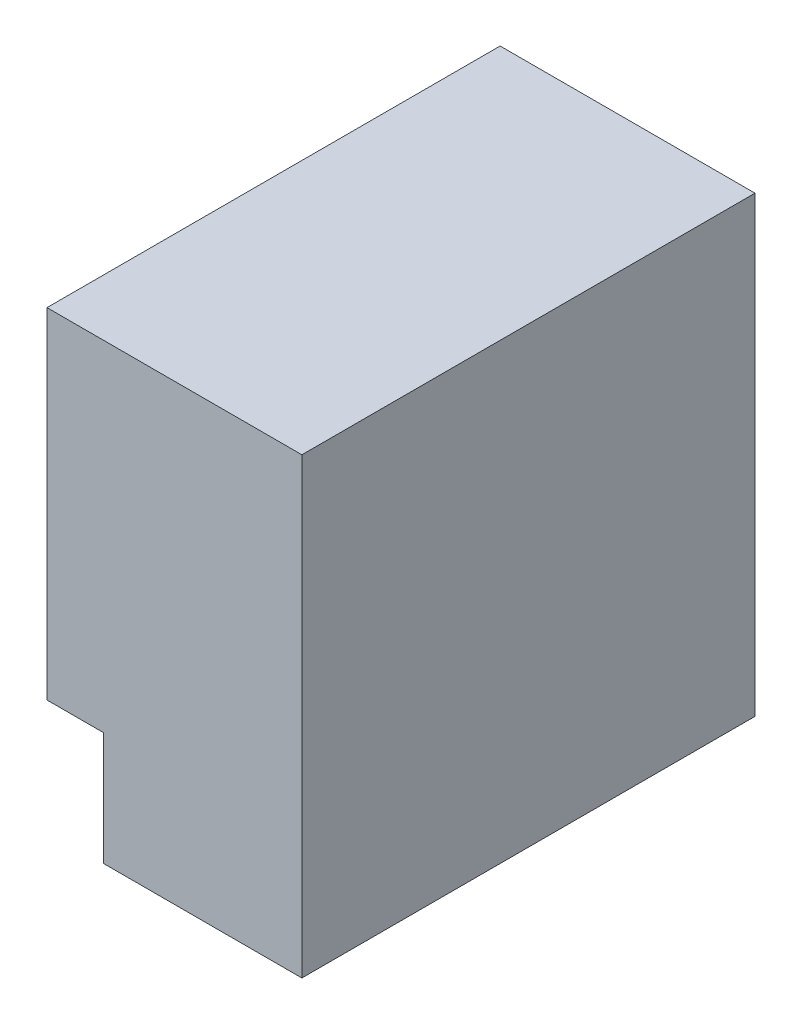
ISO-10303-21;
HEADER;
FILE_DESCRIPTION(('STEP AP214'),'2;1');
FILE_NAME('part.step','',(''),(''),'','','');
FILE_SCHEMA(('AUTOMOTIVE_DESIGN { 1 0 10303 214 1 1 1 1 }'));
ENDSEC;
DATA;
#1=APPLICATION_CONTEXT('core data for automotive mechanical design processes');
#2=APPLICATION_PROTOCOL_DEFINITION('international standard','automotive_design',2000,#1);
#3=PRODUCT_CONTEXT('',#1,'mechanical');
#4=PRODUCT('Part','Part','',(#3));
#5=PRODUCT_RELATED_PRODUCT_CATEGORY('part','',(#4));
#6=PRODUCT_DEFINITION_FORMATION('','',#4);
#7=PRODUCT_DEFINITION_CONTEXT('part definition',#1,'design');
#8=PRODUCT_DEFINITION('design','',#6,#7);
#9=PRODUCT_DEFINITION_SHAPE('','',#8);
#10=(LENGTH_UNIT() NAMED_UNIT(*) SI_UNIT(.MILLI.,.METRE.));
#11=(NAMED_UNIT(*) PLANE_ANGLE_UNIT() SI_UNIT($,.RADIAN.));
#12=(NAMED_UNIT(*) SI_UNIT($,.STERADIAN.) SOLID_ANGLE_UNIT());
#13=UNCERTAINTY_MEASURE_WITH_UNIT(LENGTH_MEASURE(1.E-05),#10,'distance_accuracy_value','');
#14=(GEOMETRIC_REPRESENTATION_CONTEXT(3) GLOBAL_UNCERTAINTY_ASSIGNED_CONTEXT((#13)) GLOBAL_UNIT_ASSIGNED_CONTEXT((#10,
#11,#12)) REPRESENTATION_CONTEXT('',''));
#15=CARTESIAN_POINT('',(0.,0.,0.));
#16=DIRECTION('',(0.,0.,1.));
#17=DIRECTION('',(1.,0.,0.));
#18=AXIS2_PLACEMENT_3D('',#15,#16,#17);
#19=CARTESIAN_POINT('',(-16.6432255553676,43.0000000000214,-14.870292169545));
#20=DIRECTION('',(1.,0.,0.));
#21=DIRECTION('',(0.,0.,-1.));
#22=AXIS2_PLACEMENT_3D('',#19,#20,#21);
#23=PLANE('',#22);
#24=CARTESIAN_POINT('',(-16.6432255553676,23.0000000000214,5.12970783045501));
#25=DIRECTION('',(-1.,0.,0.));
#26=DIRECTION('',(0.,0.,1.));
#27=AXIS2_PLACEMENT_3D('',#24,#25,#26);
#28=CIRCLE('',#27,1.24999999999999);
#29=CARTESIAN_POINT('',(-16.6432255553676,23.0000000000214,6.379707830455));
#30=VERTEX_POINT('',#29);
#31=EDGE_CURVE('E130',#30,#30,#28,.T.);
#32=ORIENTED_EDGE('',*,*,#31,.F.);
#33=EDGE_LOOP('',(#32));
#34=FACE_BOUND('',#33,.T.);
#35=DIRECTION('',(0.,-1.,0.));
#36=VECTOR('',#35,1.);
#37=CARTESIAN_POINT('',(-16.6432255553676,43.0000000000214,-14.870292169545));
#38=LINE('',#37,#36);
#39=CARTESIAN_POINT('',(-16.6432255553676,43.0000000000214,-14.870292169545));
#40=VERTEX_POINT('',#39);
#41=CARTESIAN_POINT('',(-16.6432255553676,13.0000000000214,-14.870292169545));
#42=VERTEX_POINT('',#41);
#43=EDGE_CURVE('E45',#40,#42,#38,.T.);
#44=ORIENTED_EDGE('',*,*,#43,.T.);
#45=DIRECTION('',(0.,0.,1.));
#46=VECTOR('',#45,1.);
#47=CARTESIAN_POINT('',(-16.6432255553676,13.0000000000214,-14.870292169545));
#48=LINE('',#47,#46);
#49=CARTESIAN_POINT('',(-16.6432255553676,13.0000000000214,25.129707830455));
#50=VERTEX_POINT('',#49);
#51=EDGE_CURVE('E152',#42,#50,#48,.T.);
#52=ORIENTED_EDGE('',*,*,#51,.T.);
#53=DIRECTION('',(0.,-1.,0.));
#54=VECTOR('',#53,1.);
#55=CARTESIAN_POINT('',(-16.6432255553676,43.0000000000214,25.129707830455));
#56=LINE('',#55,#54);
#57=CARTESIAN_POINT('',(-16.6432255553676,43.0000000000214,25.129707830455));
#58=VERTEX_POINT('',#57);
#59=EDGE_CURVE('E173',#58,#50,#56,.T.);
#60=ORIENTED_EDGE('',*,*,#59,.F.);
#61=DIRECTION('',(0.,0.,1.));
#62=VECTOR('',#61,1.);
#63=CARTESIAN_POINT('',(-16.6432255553676,43.0000000000214,-14.870292169545));
#64=LINE('',#63,#62);
#65=EDGE_CURVE('E162',#40,#58,#64,.T.);
#66=ORIENTED_EDGE('',*,*,#65,.F.);
#67=EDGE_LOOP('',(#44,#52,#60,#66));
#68=FACE_BOUND('',#67,.T.);
#69=CARTESIAN_POINT('',(-16.6432255553676,33.0000000000214,5.12970783045501));
#70=DIRECTION('',(-1.,0.,0.));
#71=DIRECTION('',(0.,0.,1.));
#72=AXIS2_PLACEMENT_3D('',#69,#70,#71);
#73=CIRCLE('',#72,1.24999999999999);
#74=CARTESIAN_POINT('',(-16.6432255553676,33.0000000000214,6.379707830455));
#75=VERTEX_POINT('',#74);
#76=EDGE_CURVE('E136',#75,#75,#73,.T.);
#77=ORIENTED_EDGE('',*,*,#76,.F.);
#78=EDGE_LOOP('',(#77));
#79=FACE_BOUND('',#78,.T.);
#80=ADVANCED_FACE('F37',(#34,#68,#79),#23,.F.);
#81=CARTESIAN_POINT('',(5.85677444463244,43.0000000000214,-14.870292169545));
#82=DIRECTION('',(-1.,0.,0.));
#83=DIRECTION('',(0.,0.,1.));
#84=AXIS2_PLACEMENT_3D('',#81,#82,#83);
#85=PLANE('',#84);
#86=DIRECTION('',(0.,0.,-1.));
#87=VECTOR('',#86,1.);
#88=CARTESIAN_POINT('',(5.85677444463244,3.00000000002137,-14.870292169545));
#89=LINE('',#88,#87);
#90=CARTESIAN_POINT('',(5.85677444463244,3.00000000002137,25.129707830455));
#91=VERTEX_POINT('',#90);
#92=CARTESIAN_POINT('',(5.85677444463244,3.00000000002137,-14.870292169545));
#93=VERTEX_POINT('',#92);
#94=EDGE_CURVE('E155',#91,#93,#89,.T.);
#95=ORIENTED_EDGE('',*,*,#94,.T.);
#96=DIRECTION('',(0.,-1.,0.));
#97=VECTOR('',#96,1.);
#98=CARTESIAN_POINT('',(5.85677444463244,43.0000000000214,-14.870292169545));
#99=LINE('',#98,#97);
#100=CARTESIAN_POINT('',(5.85677444463244,43.0000000000214,-14.870292169545));
#101=VERTEX_POINT('',#100);
#102=EDGE_CURVE('E11',#101,#93,#99,.T.);
#103=ORIENTED_EDGE('',*,*,#102,.F.);
#104=DIRECTION('',(0.,0.,-1.));
#105=VECTOR('',#104,1.);
#106=CARTESIAN_POINT('',(5.85677444463244,43.0000000000214,-14.870292169545));
#107=LINE('',#106,#105);
#108=CARTESIAN_POINT('',(5.85677444463244,43.0000000000214,25.129707830455));
#109=VERTEX_POINT('',#108);
#110=EDGE_CURVE('E159',#109,#101,#107,.T.);
#111=ORIENTED_EDGE('',*,*,#110,.F.);
#112=DIRECTION('',(0.,-1.,0.));
#113=VECTOR('',#112,1.);
#114=CARTESIAN_POINT('',(5.85677444463244,43.0000000000214,25.129707830455));
#115=LINE('',#114,#113);
#116=EDGE_CURVE('E165',#109,#91,#115,.T.);
#117=ORIENTED_EDGE('',*,*,#116,.T.);
#118=EDGE_LOOP('',(#95,#103,#111,#117));
#119=FACE_BOUND('',#118,.T.);
#120=ADVANCED_FACE('F39',(#119),#85,.F.);
#121=CARTESIAN_POINT('',(5.85677444463244,43.0000000000214,-14.870292169545));
#122=DIRECTION('',(0.,0.,1.));
#123=DIRECTION('',(1.,0.,0.));
#124=AXIS2_PLACEMENT_3D('',#121,#122,#123);
#125=PLANE('',#124);
#126=DIRECTION('',(0.,1.,0.));
#127=VECTOR('',#126,1.);
#128=CARTESIAN_POINT('',(-11.6432255553676,3.00000000002137,-14.870292169545));
#129=LINE('',#128,#127);
#130=CARTESIAN_POINT('',(-11.6432255553676,3.00000000002137,-14.870292169545));
#131=VERTEX_POINT('',#130);
#132=CARTESIAN_POINT('',(-11.6432255553676,13.0000000000214,-14.870292169545));
#133=VERTEX_POINT('',#132);
#134=EDGE_CURVE('E52',#131,#133,#129,.T.);
#135=ORIENTED_EDGE('',*,*,#134,.T.);
#136=DIRECTION('',(-1.,0.,0.));
#137=VECTOR('',#136,1.);
#138=CARTESIAN_POINT('',(-16.6432255553676,13.0000000000214,-14.870292169545));
#139=LINE('',#138,#137);
#140=EDGE_CURVE('E144',#133,#42,#139,.T.);
#141=ORIENTED_EDGE('',*,*,#140,.T.);
#142=ORIENTED_EDGE('',*,*,#43,.F.);
#143=DIRECTION('',(-1.,0.,0.));
#144=VECTOR('',#143,1.);
#145=CARTESIAN_POINT('',(5.85677444463244,43.0000000000214,-14.870292169545));
#146=LINE('',#145,#144);
#147=EDGE_CURVE('E83',#101,#40,#146,.T.);
#148=ORIENTED_EDGE('',*,*,#147,.F.);
#149=ORIENTED_EDGE('',*,*,#102,.T.);
#150=DIRECTION('',(-1.,0.,0.));
#151=VECTOR('',#150,1.);
#152=CARTESIAN_POINT('',(5.85677444463244,3.00000000002137,-14.870292169545));
#153=LINE('',#152,#151);
#154=EDGE_CURVE('E168',#93,#131,#153,.T.);
#155=ORIENTED_EDGE('',*,*,#154,.T.);
#156=EDGE_LOOP('',(#135,#141,#142,#148,#149,#155));
#157=FACE_BOUND('',#156,.T.);
#158=ADVANCED_FACE('F180',(#157),#125,.F.);
#159=CARTESIAN_POINT('',(5.85677444463244,43.0000000000214,25.129707830455));
#160=DIRECTION('',(0.,0.,-1.));
#161=DIRECTION('',(-1.,0.,0.));
#162=AXIS2_PLACEMENT_3D('',#159,#160,#161);
#163=PLANE('',#162);
#164=ORIENTED_EDGE('',*,*,#59,.T.);
#165=DIRECTION('',(-1.,0.,0.));
#166=VECTOR('',#165,1.);
#167=CARTESIAN_POINT('',(-16.6432255553676,13.0000000000214,25.129707830455));
#168=LINE('',#167,#166);
#169=CARTESIAN_POINT('',(-11.6432255553676,13.0000000000214,25.129707830455));
#170=VERTEX_POINT('',#169);
#171=EDGE_CURVE('E145',#170,#50,#168,.T.);
#172=ORIENTED_EDGE('',*,*,#171,.F.);
#173=DIRECTION('',(0.,1.,0.));
#174=VECTOR('',#173,1.);
#175=CARTESIAN_POINT('',(-11.6432255553676,3.00000000002137,25.129707830455));
#176=LINE('',#175,#174);
#177=CARTESIAN_POINT('',(-11.6432255553676,3.00000000002137,25.129707830455));
#178=VERTEX_POINT('',#177);
#179=EDGE_CURVE('E142',#178,#170,#176,.T.);
#180=ORIENTED_EDGE('',*,*,#179,.F.);
#181=DIRECTION('',(1.,0.,0.));
#182=VECTOR('',#181,1.);
#183=CARTESIAN_POINT('',(5.85677444463244,3.00000000002137,25.129707830455));
#184=LINE('',#183,#182);
#185=EDGE_CURVE('E76',#178,#91,#184,.T.);
#186=ORIENTED_EDGE('',*,*,#185,.T.);
#187=ORIENTED_EDGE('',*,*,#116,.F.);
#188=DIRECTION('',(1.,0.,0.));
#189=VECTOR('',#188,1.);
#190=CARTESIAN_POINT('',(5.85677444463244,43.0000000000214,25.129707830455));
#191=LINE('',#190,#189);
#192=EDGE_CURVE('E61',#58,#109,#191,.T.);
#193=ORIENTED_EDGE('',*,*,#192,.F.);
#194=EDGE_LOOP('',(#164,#172,#180,#186,#187,#193));
#195=FACE_BOUND('',#194,.T.);
#196=ADVANCED_FACE('F185',(#195),#163,.F.);
#197=CARTESIAN_POINT('',(5.85677444463244,43.0000000000214,25.129707830455));
#198=DIRECTION('',(0.,-1.,0.));
#199=DIRECTION('',(0.,0.,-1.));
#200=AXIS2_PLACEMENT_3D('',#197,#198,#199);
#201=PLANE('',#200);
#202=ORIENTED_EDGE('',*,*,#110,.T.);
#203=ORIENTED_EDGE('',*,*,#147,.T.);
#204=ORIENTED_EDGE('',*,*,#65,.T.);
#205=ORIENTED_EDGE('',*,*,#192,.T.);
#206=EDGE_LOOP('',(#202,#203,#204,#205));
#207=FACE_BOUND('',#206,.T.);
#208=ADVANCED_FACE('F190',(#207),#201,.F.);
#209=CARTESIAN_POINT('',(5.85677444463244,3.00000000002137,25.129707830455));
#210=DIRECTION('',(0.,-1.,0.));
#211=DIRECTION('',(0.,0.,-1.));
#212=AXIS2_PLACEMENT_3D('',#209,#210,#211);
#213=PLANE('',#212);
#214=CARTESIAN_POINT('',(-2.14322555536756,3.00000000002137,17.1297078304551));
#215=DIRECTION('',(0.,-1.,0.));
#216=DIRECTION('',(0.,0.,-1.));
#217=AXIS2_PLACEMENT_3D('',#214,#215,#216);
#218=CIRCLE('',#217,1.24999999999999);
#219=CARTESIAN_POINT('',(-2.14322555536756,3.00000000002137,15.8797078304551));
#220=VERTEX_POINT('',#219);
#221=EDGE_CURVE('E120',#220,#220,#218,.T.);
#222=ORIENTED_EDGE('',*,*,#221,.F.);
#223=EDGE_LOOP('',(#222));
#224=FACE_BOUND('',#223,.T.);
#225=CARTESIAN_POINT('',(-2.14322555536756,3.00000000002137,-6.87029216954493));
#226=DIRECTION('',(0.,-1.,0.));
#227=DIRECTION('',(0.,0.,-1.));
#228=AXIS2_PLACEMENT_3D('',#225,#226,#227);
#229=CIRCLE('',#228,1.24999999999999);
#230=CARTESIAN_POINT('',(-2.14322555536756,3.00000000002137,-8.12029216954492));
#231=VERTEX_POINT('',#230);
#232=EDGE_CURVE('E119',#231,#231,#229,.T.);
#233=ORIENTED_EDGE('',*,*,#232,.F.);
#234=EDGE_LOOP('',(#233));
#235=FACE_BOUND('',#234,.T.);
#236=DIRECTION('',(0.,0.,1.));
#237=VECTOR('',#236,1.);
#238=CARTESIAN_POINT('',(-11.6432255553676,3.00000000002137,-14.870292169545));
#239=LINE('',#238,#237);
#240=EDGE_CURVE('E148',#131,#178,#239,.T.);
#241=ORIENTED_EDGE('',*,*,#240,.F.);
#242=ORIENTED_EDGE('',*,*,#154,.F.);
#243=ORIENTED_EDGE('',*,*,#94,.F.);
#244=ORIENTED_EDGE('',*,*,#185,.F.);
#245=EDGE_LOOP('',(#241,#242,#243,#244));
#246=FACE_BOUND('',#245,.T.);
#247=ADVANCED_FACE('F192',(#224,#235,#246),#213,.T.);
#248=CARTESIAN_POINT('',(-16.6432255553676,13.0000000000214,-14.870292169545));
#249=DIRECTION('',(0.,1.,0.));
#250=DIRECTION('',(0.,0.,1.));
#251=AXIS2_PLACEMENT_3D('',#248,#249,#250);
#252=PLANE('',#251);
#253=ORIENTED_EDGE('',*,*,#171,.T.);
#254=ORIENTED_EDGE('',*,*,#51,.F.);
#255=ORIENTED_EDGE('',*,*,#140,.F.);
#256=DIRECTION('',(0.,0.,1.));
#257=VECTOR('',#256,1.);
#258=CARTESIAN_POINT('',(-11.6432255553676,13.0000000000214,-14.870292169545));
#259=LINE('',#258,#257);
#260=EDGE_CURVE('E156',#133,#170,#259,.T.);
#261=ORIENTED_EDGE('',*,*,#260,.T.);
#262=EDGE_LOOP('',(#253,#254,#255,#261));
#263=FACE_BOUND('',#262,.T.);
#264=ADVANCED_FACE('F183',(#263),#252,.F.);
#265=CARTESIAN_POINT('',(-11.6432255553676,3.00000000002137,-14.870292169545));
#266=DIRECTION('',(1.,0.,0.));
#267=DIRECTION('',(0.,0.,-1.));
#268=AXIS2_PLACEMENT_3D('',#265,#266,#267);
#269=PLANE('',#268);
#270=ORIENTED_EDGE('',*,*,#179,.T.);
#271=ORIENTED_EDGE('',*,*,#260,.F.);
#272=ORIENTED_EDGE('',*,*,#134,.F.);
#273=ORIENTED_EDGE('',*,*,#240,.T.);
#274=EDGE_LOOP('',(#270,#271,#272,#273));
#275=FACE_BOUND('',#274,.T.);
#276=ADVANCED_FACE('F228',(#275),#269,.F.);
#277=CARTESIAN_POINT('',(-10.1432255553676,33.0000000000214,5.12970783045501));
#278=DIRECTION('',(-1.,0.,0.));
#279=DIRECTION('',(0.,0.,1.));
#280=AXIS2_PLACEMENT_3D('',#277,#278,#279);
#281=CONICAL_SURFACE('',#280,1.25,1.02974425867665);
#282=CARTESIAN_POINT('',(-9.3921497815831,33.0000000000214,5.12970783045501));
#283=VERTEX_POINT('',#282);
#284=VERTEX_LOOP('',#283);
#285=FACE_BOUND('',#284,.T.);
#286=CARTESIAN_POINT('',(-10.1432255553676,33.0000000000214,5.12970783045501));
#287=DIRECTION('',(-1.,0.,0.));
#288=DIRECTION('',(0.,0.,1.));
#289=AXIS2_PLACEMENT_3D('',#286,#287,#288);
#290=CIRCLE('',#289,1.25);
#291=CARTESIAN_POINT('',(-10.1432255553676,33.0000000000214,6.37970783045501));
#292=VERTEX_POINT('',#291);
#293=EDGE_CURVE('E139',#292,#292,#290,.T.);
#294=ORIENTED_EDGE('',*,*,#293,.T.);
#295=EDGE_LOOP('',(#294));
#296=FACE_BOUND('',#295,.T.);
#297=ADVANCED_FACE('F237',(#285,#296),#281,.F.);
#298=CARTESIAN_POINT('',(-16.6432255553676,33.0000000000214,5.12970783045501));
#299=DIRECTION('',(-1.,0.,0.));
#300=DIRECTION('',(0.,0.,1.));
#301=AXIS2_PLACEMENT_3D('',#298,#299,#300);
#302=CYLINDRICAL_SURFACE('',#301,1.24999999999999);
#303=ORIENTED_EDGE('',*,*,#293,.F.);
#304=EDGE_LOOP('',(#303));
#305=FACE_BOUND('',#304,.T.);
#306=ORIENTED_EDGE('',*,*,#76,.T.);
#307=EDGE_LOOP('',(#306));
#308=FACE_BOUND('',#307,.T.);
#309=ADVANCED_FACE('F250',(#305,#308),#302,.F.);
#310=CARTESIAN_POINT('',(-10.1432255553676,23.0000000000214,5.12970783045501));
#311=DIRECTION('',(-1.,0.,0.));
#312=DIRECTION('',(0.,0.,1.));
#313=AXIS2_PLACEMENT_3D('',#310,#311,#312);
#314=CONICAL_SURFACE('',#313,1.25,1.02974425867665);
#315=CARTESIAN_POINT('',(-9.3921497815831,23.0000000000214,5.12970783045501));
#316=VERTEX_POINT('',#315);
#317=VERTEX_LOOP('',#316);
#318=FACE_BOUND('',#317,.T.);
#319=CARTESIAN_POINT('',(-10.1432255553676,23.0000000000214,5.12970783045501));
#320=DIRECTION('',(-1.,0.,0.));
#321=DIRECTION('',(0.,0.,1.));
#322=AXIS2_PLACEMENT_3D('',#319,#320,#321);
#323=CIRCLE('',#322,1.25);
#324=CARTESIAN_POINT('',(-10.1432255553676,23.0000000000214,6.37970783045501));
#325=VERTEX_POINT('',#324);
#326=EDGE_CURVE('E133',#325,#325,#323,.T.);
#327=ORIENTED_EDGE('',*,*,#326,.T.);
#328=EDGE_LOOP('',(#327));
#329=FACE_BOUND('',#328,.T.);
#330=ADVANCED_FACE('F261',(#318,#329),#314,.F.);
#331=CARTESIAN_POINT('',(-16.6432255553676,23.0000000000214,5.12970783045501));
#332=DIRECTION('',(-1.,0.,0.));
#333=DIRECTION('',(0.,0.,1.));
#334=AXIS2_PLACEMENT_3D('',#331,#332,#333);
#335=CYLINDRICAL_SURFACE('',#334,1.24999999999999);
#336=ORIENTED_EDGE('',*,*,#326,.F.);
#337=EDGE_LOOP('',(#336));
#338=FACE_BOUND('',#337,.T.);
#339=ORIENTED_EDGE('',*,*,#31,.T.);
#340=EDGE_LOOP('',(#339));
#341=FACE_BOUND('',#340,.T.);
#342=ADVANCED_FACE('F274',(#338,#341),#335,.F.);
#343=CARTESIAN_POINT('',(-2.14322555536756,9.50000000002138,-6.87029216954493));
#344=DIRECTION('',(0.,-1.,0.));
#345=DIRECTION('',(0.,0.,-1.));
#346=AXIS2_PLACEMENT_3D('',#343,#344,#345);
#347=CONICAL_SURFACE('',#346,1.24999999999999,1.02974425867665);
#348=CARTESIAN_POINT('',(-2.14322555536756,10.2510757738058,-6.87029216954493));
#349=VERTEX_POINT('',#348);
#350=VERTEX_LOOP('',#349);
#351=FACE_BOUND('',#350,.T.);
#352=CARTESIAN_POINT('',(-2.14322555536756,9.50000000002138,-6.87029216954493));
#353=DIRECTION('',(0.,-1.,0.));
#354=DIRECTION('',(0.,0.,-1.));
#355=AXIS2_PLACEMENT_3D('',#352,#353,#354);
#356=CIRCLE('',#355,1.24999999999999);
#357=CARTESIAN_POINT('',(-2.14322555536756,9.50000000002138,-8.12029216954491));
#358=VERTEX_POINT('',#357);
#359=EDGE_CURVE('E123',#358,#358,#356,.T.);
#360=ORIENTED_EDGE('',*,*,#359,.T.);
#361=EDGE_LOOP('',(#360));
#362=FACE_BOUND('',#361,.T.);
#363=ADVANCED_FACE('F284',(#351,#362),#347,.F.);
#364=CARTESIAN_POINT('',(-2.14322555536756,3.00000000002137,-6.87029216954493));
#365=DIRECTION('',(0.,-1.,0.));
#366=DIRECTION('',(0.,0.,-1.));
#367=AXIS2_PLACEMENT_3D('',#364,#365,#366);
#368=CYLINDRICAL_SURFACE('',#367,1.24999999999999);
#369=ORIENTED_EDGE('',*,*,#359,.F.);
#370=EDGE_LOOP('',(#369));
#371=FACE_BOUND('',#370,.T.);
#372=ORIENTED_EDGE('',*,*,#232,.T.);
#373=EDGE_LOOP('',(#372));
#374=FACE_BOUND('',#373,.T.);
#375=ADVANCED_FACE('F113',(#371,#374),#368,.F.);
#376=CARTESIAN_POINT('',(-2.14322555536756,9.50000000002138,17.1297078304551));
#377=DIRECTION('',(0.,-1.,0.));
#378=DIRECTION('',(0.,0.,-1.));
#379=AXIS2_PLACEMENT_3D('',#376,#377,#378);
#380=CONICAL_SURFACE('',#379,1.24999999999999,1.02974425867665);
#381=CARTESIAN_POINT('',(-2.14322555536756,10.2510757738058,17.1297078304551));
#382=VERTEX_POINT('',#381);
#383=VERTEX_LOOP('',#382);
#384=FACE_BOUND('',#383,.T.);
#385=CARTESIAN_POINT('',(-2.14322555536756,9.50000000002138,17.1297078304551));
#386=DIRECTION('',(0.,-1.,0.));
#387=DIRECTION('',(0.,0.,-1.));
#388=AXIS2_PLACEMENT_3D('',#385,#386,#387);
#389=CIRCLE('',#388,1.24999999999999);
#390=CARTESIAN_POINT('',(-2.14322555536756,9.50000000002138,15.8797078304551));
#391=VERTEX_POINT('',#390);
#392=EDGE_CURVE('E117',#391,#391,#389,.T.);
#393=ORIENTED_EDGE('',*,*,#392,.T.);
#394=EDGE_LOOP('',(#393));
#395=FACE_BOUND('',#394,.T.);
#396=ADVANCED_FACE('F109',(#384,#395),#380,.F.);
#397=CARTESIAN_POINT('',(-2.14322555536756,3.00000000002137,17.1297078304551));
#398=DIRECTION('',(0.,-1.,0.));
#399=DIRECTION('',(0.,0.,-1.));
#400=AXIS2_PLACEMENT_3D('',#397,#398,#399);
#401=CYLINDRICAL_SURFACE('',#400,1.24999999999999);
#402=ORIENTED_EDGE('',*,*,#392,.F.);
#403=EDGE_LOOP('',(#402));
#404=FACE_BOUND('',#403,.T.);
#405=ORIENTED_EDGE('',*,*,#221,.T.);
#406=EDGE_LOOP('',(#405));
#407=FACE_BOUND('',#406,.T.);
#408=ADVANCED_FACE('F112',(#404,#407),#401,.F.);
#409=CLOSED_SHELL('',(#80,#120,#158,#196,#208,#247,#264,#276,#297,#309,#330,#342,#363,#375,#396,#408));
#410=MANIFOLD_SOLID_BREP('B2',#409);
#411=ADVANCED_BREP_SHAPE_REPRESENTATION('',(#18,#410),#14);
#412=SHAPE_DEFINITION_REPRESENTATION(#9,#411);
ENDSEC;
END-ISO-10303-21;
